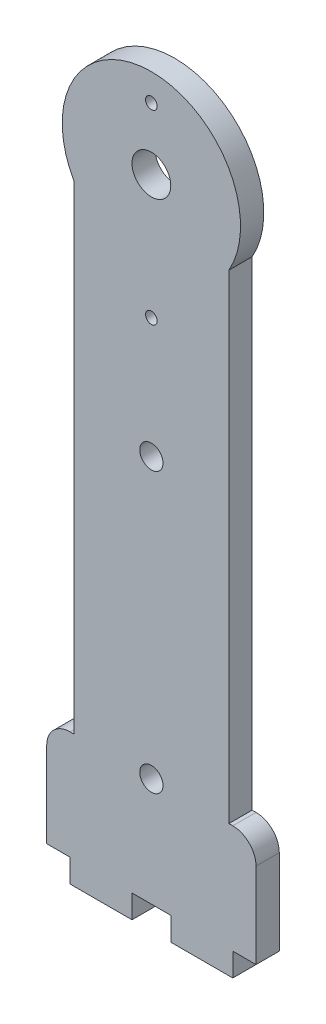
ISO-10303-21;
HEADER;
FILE_DESCRIPTION(('STEP AP214'),'2;1');
FILE_NAME('part.step','',(''),(''),'','','');
FILE_SCHEMA(('AUTOMOTIVE_DESIGN { 1 0 10303 214 1 1 1 1 }'));
ENDSEC;
DATA;
#1=APPLICATION_CONTEXT('core data for automotive mechanical design processes');
#2=APPLICATION_PROTOCOL_DEFINITION('international standard','automotive_design',2000,#1);
#3=PRODUCT_CONTEXT('',#1,'mechanical');
#4=PRODUCT('Part','Part','',(#3));
#5=PRODUCT_RELATED_PRODUCT_CATEGORY('part','',(#4));
#6=PRODUCT_DEFINITION_FORMATION('','',#4);
#7=PRODUCT_DEFINITION_CONTEXT('part definition',#1,'design');
#8=PRODUCT_DEFINITION('design','',#6,#7);
#9=PRODUCT_DEFINITION_SHAPE('','',#8);
#10=(LENGTH_UNIT() NAMED_UNIT(*) SI_UNIT(.MILLI.,.METRE.));
#11=(NAMED_UNIT(*) PLANE_ANGLE_UNIT() SI_UNIT($,.RADIAN.));
#12=(NAMED_UNIT(*) SI_UNIT($,.STERADIAN.) SOLID_ANGLE_UNIT());
#13=UNCERTAINTY_MEASURE_WITH_UNIT(LENGTH_MEASURE(1.E-05),#10,'distance_accuracy_value','');
#14=(GEOMETRIC_REPRESENTATION_CONTEXT(3) GLOBAL_UNCERTAINTY_ASSIGNED_CONTEXT((#13)) GLOBAL_UNIT_ASSIGNED_CONTEXT((#10,
#11,#12)) REPRESENTATION_CONTEXT('',''));
#15=CARTESIAN_POINT('',(0.,0.,0.));
#16=DIRECTION('',(0.,0.,1.));
#17=DIRECTION('',(1.,0.,0.));
#18=AXIS2_PLACEMENT_3D('',#15,#16,#17);
#19=CARTESIAN_POINT('',(0.,-81.5,3.));
#20=DIRECTION('',(0.,-1.,0.));
#21=DIRECTION('',(0.,0.,-1.));
#22=AXIS2_PLACEMENT_3D('',#19,#20,#21);
#23=PLANE('',#22);
#24=DIRECTION('',(0.,0.,1.));
#25=VECTOR('',#24,1.);
#26=CARTESIAN_POINT('',(2.50000000000001,-81.5,0.));
#27=LINE('',#26,#25);
#28=CARTESIAN_POINT('',(2.50000000000001,-81.5,0.));
#29=VERTEX_POINT('',#28);
#30=CARTESIAN_POINT('',(2.50000000000001,-81.5,3.));
#31=VERTEX_POINT('',#30);
#32=EDGE_CURVE('E216',#29,#31,#27,.T.);
#33=ORIENTED_EDGE('',*,*,#32,.T.);
#34=DIRECTION('',(-1.,0.,0.));
#35=VECTOR('',#34,1.);
#36=CARTESIAN_POINT('',(0.,-81.5,3.));
#37=LINE('',#36,#35);
#38=CARTESIAN_POINT('',(-2.50000000000001,-81.5,3.));
#39=VERTEX_POINT('',#38);
#40=EDGE_CURVE('E302',#31,#39,#37,.T.);
#41=ORIENTED_EDGE('',*,*,#40,.T.);
#42=DIRECTION('',(0.,0.,1.));
#43=VECTOR('',#42,1.);
#44=CARTESIAN_POINT('',(-2.50000000000001,-81.5,0.));
#45=LINE('',#44,#43);
#46=CARTESIAN_POINT('',(-2.50000000000001,-81.5,0.));
#47=VERTEX_POINT('',#46);
#48=EDGE_CURVE('E252',#47,#39,#45,.T.);
#49=ORIENTED_EDGE('',*,*,#48,.F.);
#50=DIRECTION('',(-1.,0.,0.));
#51=VECTOR('',#50,1.);
#52=CARTESIAN_POINT('',(0.,-81.5,0.));
#53=LINE('',#52,#51);
#54=EDGE_CURVE('E83',#29,#47,#53,.T.);
#55=ORIENTED_EDGE('',*,*,#54,.F.);
#56=EDGE_LOOP('',(#33,#41,#49,#55));
#57=FACE_BOUND('',#56,.T.);
#58=ADVANCED_FACE('F68',(#57),#23,.T.);
#59=CARTESIAN_POINT('',(-10.5,-81.5,0.));
#60=VERTEX_POINT('',#59);
#61=CARTESIAN_POINT('',(-13.5,-81.5,0.));
#62=VERTEX_POINT('',#61);
#63=EDGE_CURVE('E318',#60,#62,#53,.T.);
#64=ORIENTED_EDGE('',*,*,#63,.F.);
#65=DIRECTION('',(0.,0.,1.));
#66=VECTOR('',#65,1.);
#67=CARTESIAN_POINT('',(-10.5,-81.5,0.));
#68=LINE('',#67,#66);
#69=CARTESIAN_POINT('',(-10.5,-81.5,3.));
#70=VERTEX_POINT('',#69);
#71=EDGE_CURVE('E248',#60,#70,#68,.T.);
#72=ORIENTED_EDGE('',*,*,#71,.T.);
#73=CARTESIAN_POINT('',(-13.5,-81.5,3.));
#74=VERTEX_POINT('',#73);
#75=EDGE_CURVE('E298',#70,#74,#37,.T.);
#76=ORIENTED_EDGE('',*,*,#75,.T.);
#77=DIRECTION('',(0.,0.,-1.));
#78=VECTOR('',#77,1.);
#79=CARTESIAN_POINT('',(-13.5,-81.5,3.));
#80=LINE('',#79,#78);
#81=EDGE_CURVE('E332',#74,#62,#80,.T.);
#82=ORIENTED_EDGE('',*,*,#81,.T.);
#83=EDGE_LOOP('',(#64,#72,#76,#82));
#84=FACE_BOUND('',#83,.T.);
#85=ADVANCED_FACE('F387',(#84),#23,.T.);
#86=CARTESIAN_POINT('',(-9.99999999999999,0.,3.));
#87=DIRECTION('',(1.,0.,0.));
#88=DIRECTION('',(0.,1.,0.));
#89=AXIS2_PLACEMENT_3D('',#86,#87,#88);
#90=PLANE('',#89);
#91=DIRECTION('',(0.,-1.,0.));
#92=VECTOR('',#91,1.);
#93=CARTESIAN_POINT('',(-9.99999999999999,0.,0.));
#94=LINE('',#93,#92);
#95=CARTESIAN_POINT('',(-9.99999999999999,-5.67890834580029,0.));
#96=VERTEX_POINT('',#95);
#97=CARTESIAN_POINT('',(-9.99999999999999,-67.5,0.));
#98=VERTEX_POINT('',#97);
#99=EDGE_CURVE('E308',#96,#98,#94,.T.);
#100=ORIENTED_EDGE('',*,*,#99,.T.);
#101=DIRECTION('',(0.,0.,-1.));
#102=VECTOR('',#101,1.);
#103=CARTESIAN_POINT('',(-9.99999999999999,-67.5,3.));
#104=LINE('',#103,#102);
#105=CARTESIAN_POINT('',(-9.99999999999999,-67.5,3.));
#106=VERTEX_POINT('',#105);
#107=EDGE_CURVE('E335',#106,#98,#104,.T.);
#108=ORIENTED_EDGE('',*,*,#107,.F.);
#109=DIRECTION('',(0.,-1.,0.));
#110=VECTOR('',#109,1.);
#111=CARTESIAN_POINT('',(-9.99999999999999,0.,3.));
#112=LINE('',#111,#110);
#113=CARTESIAN_POINT('',(-9.99999999999999,-5.67890834580029,3.));
#114=VERTEX_POINT('',#113);
#115=EDGE_CURVE('E288',#114,#106,#112,.T.);
#116=ORIENTED_EDGE('',*,*,#115,.F.);
#117=DIRECTION('',(0.,0.,-1.));
#118=VECTOR('',#117,1.);
#119=CARTESIAN_POINT('',(-9.99999999999999,-5.67890834580029,3.));
#120=LINE('',#119,#118);
#121=EDGE_CURVE('E338',#114,#96,#120,.T.);
#122=ORIENTED_EDGE('',*,*,#121,.T.);
#123=EDGE_LOOP('',(#100,#108,#116,#122));
#124=FACE_BOUND('',#123,.T.);
#125=ADVANCED_FACE('F394',(#124),#90,.F.);
#126=CARTESIAN_POINT('',(0.,-67.5,3.));
#127=DIRECTION('',(0.,-1.,0.));
#128=DIRECTION('',(0.,0.,-1.));
#129=AXIS2_PLACEMENT_3D('',#126,#127,#128);
#130=PLANE('',#129);
#131=DIRECTION('',(-1.,0.,0.));
#132=VECTOR('',#131,1.);
#133=CARTESIAN_POINT('',(0.,-67.5,0.));
#134=LINE('',#133,#132);
#135=CARTESIAN_POINT('',(-10.5,-67.5,0.));
#136=VERTEX_POINT('',#135);
#137=EDGE_CURVE('E310',#98,#136,#134,.T.);
#138=ORIENTED_EDGE('',*,*,#137,.T.);
#139=DIRECTION('',(0.,0.,-1.));
#140=VECTOR('',#139,1.);
#141=CARTESIAN_POINT('',(-10.5,-67.5,3.));
#142=LINE('',#141,#140);
#143=CARTESIAN_POINT('',(-10.5,-67.5,3.));
#144=VERTEX_POINT('',#143);
#145=EDGE_CURVE('E351',#136,#144,#142,.F.);
#146=ORIENTED_EDGE('',*,*,#145,.T.);
#147=DIRECTION('',(-1.,0.,0.));
#148=VECTOR('',#147,1.);
#149=CARTESIAN_POINT('',(0.,-67.5,3.));
#150=LINE('',#149,#148);
#151=EDGE_CURVE('E290',#106,#144,#150,.T.);
#152=ORIENTED_EDGE('',*,*,#151,.F.);
#153=ORIENTED_EDGE('',*,*,#107,.T.);
#154=EDGE_LOOP('',(#138,#146,#152,#153));
#155=FACE_BOUND('',#154,.T.);
#156=ADVANCED_FACE('F405',(#155),#130,.F.);
#157=CARTESIAN_POINT('',(-13.5,0.,3.));
#158=DIRECTION('',(1.,0.,0.));
#159=DIRECTION('',(0.,1.,0.));
#160=AXIS2_PLACEMENT_3D('',#157,#158,#159);
#161=PLANE('',#160);
#162=DIRECTION('',(0.,-1.,0.));
#163=VECTOR('',#162,1.);
#164=CARTESIAN_POINT('',(-13.5,0.,3.));
#165=LINE('',#164,#163);
#166=CARTESIAN_POINT('',(-13.5,-70.5,3.));
#167=VERTEX_POINT('',#166);
#168=EDGE_CURVE('E294',#167,#74,#165,.T.);
#169=ORIENTED_EDGE('',*,*,#168,.F.);
#170=DIRECTION('',(0.,0.,-1.));
#171=VECTOR('',#170,1.);
#172=CARTESIAN_POINT('',(-13.5,-70.5,3.));
#173=LINE('',#172,#171);
#174=CARTESIAN_POINT('',(-13.5,-70.5,0.));
#175=VERTEX_POINT('',#174);
#176=EDGE_CURVE('E340',#167,#175,#173,.T.);
#177=ORIENTED_EDGE('',*,*,#176,.T.);
#178=DIRECTION('',(0.,-1.,0.));
#179=VECTOR('',#178,1.);
#180=CARTESIAN_POINT('',(-13.5,0.,0.));
#181=LINE('',#180,#179);
#182=EDGE_CURVE('E314',#175,#62,#181,.T.);
#183=ORIENTED_EDGE('',*,*,#182,.T.);
#184=ORIENTED_EDGE('',*,*,#81,.F.);
#185=EDGE_LOOP('',(#169,#177,#183,#184));
#186=FACE_BOUND('',#185,.T.);
#187=ADVANCED_FACE('F399',(#186),#161,.F.);
#188=DIRECTION('',(0.,0.,1.));
#189=VECTOR('',#188,1.);
#190=CARTESIAN_POINT('',(10.5,-81.5,0.));
#191=LINE('',#190,#189);
#192=CARTESIAN_POINT('',(10.5,-81.5,0.));
#193=VERTEX_POINT('',#192);
#194=CARTESIAN_POINT('',(10.5,-81.5,3.));
#195=VERTEX_POINT('',#194);
#196=EDGE_CURVE('E91',#193,#195,#191,.T.);
#197=ORIENTED_EDGE('',*,*,#196,.F.);
#198=CARTESIAN_POINT('',(13.5,-81.5,0.));
#199=VERTEX_POINT('',#198);
#200=EDGE_CURVE('E319',#199,#193,#53,.T.);
#201=ORIENTED_EDGE('',*,*,#200,.F.);
#202=DIRECTION('',(0.,0.,-1.));
#203=VECTOR('',#202,1.);
#204=CARTESIAN_POINT('',(13.5,-81.5,3.));
#205=LINE('',#204,#203);
#206=CARTESIAN_POINT('',(13.5,-81.5,3.));
#207=VERTEX_POINT('',#206);
#208=EDGE_CURVE('E329',#207,#199,#205,.T.);
#209=ORIENTED_EDGE('',*,*,#208,.F.);
#210=EDGE_CURVE('E299',#207,#195,#37,.T.);
#211=ORIENTED_EDGE('',*,*,#210,.T.);
#212=EDGE_LOOP('',(#197,#201,#209,#211));
#213=FACE_BOUND('',#212,.T.);
#214=ADVANCED_FACE('F389',(#213),#23,.T.);
#215=CARTESIAN_POINT('',(13.5,0.,3.));
#216=DIRECTION('',(1.,0.,0.));
#217=DIRECTION('',(0.,1.,0.));
#218=AXIS2_PLACEMENT_3D('',#215,#216,#217);
#219=PLANE('',#218);
#220=DIRECTION('',(0.,-1.,0.));
#221=VECTOR('',#220,1.);
#222=CARTESIAN_POINT('',(13.5,0.,0.));
#223=LINE('',#222,#221);
#224=CARTESIAN_POINT('',(13.5,-70.5,0.));
#225=VERTEX_POINT('',#224);
#226=EDGE_CURVE('E321',#225,#199,#223,.T.);
#227=ORIENTED_EDGE('',*,*,#226,.F.);
#228=DIRECTION('',(0.,0.,-1.));
#229=VECTOR('',#228,1.);
#230=CARTESIAN_POINT('',(13.5,-70.5,3.));
#231=LINE('',#230,#229);
#232=CARTESIAN_POINT('',(13.5,-70.5,3.));
#233=VERTEX_POINT('',#232);
#234=EDGE_CURVE('E12',#225,#233,#231,.F.);
#235=ORIENTED_EDGE('',*,*,#234,.T.);
#236=DIRECTION('',(0.,-1.,0.));
#237=VECTOR('',#236,1.);
#238=CARTESIAN_POINT('',(13.5,0.,3.));
#239=LINE('',#238,#237);
#240=EDGE_CURVE('E301',#233,#207,#239,.T.);
#241=ORIENTED_EDGE('',*,*,#240,.T.);
#242=ORIENTED_EDGE('',*,*,#208,.T.);
#243=EDGE_LOOP('',(#227,#235,#241,#242));
#244=FACE_BOUND('',#243,.T.);
#245=ADVANCED_FACE('F380',(#244),#219,.T.);
#246=CARTESIAN_POINT('',(10.5,-67.5,3.));
#247=VERTEX_POINT('',#246);
#248=CARTESIAN_POINT('',(10.,-67.5,3.));
#249=VERTEX_POINT('',#248);
#250=EDGE_CURVE('E295',#247,#249,#150,.T.);
#251=ORIENTED_EDGE('',*,*,#250,.F.);
#252=DIRECTION('',(0.,0.,-1.));
#253=VECTOR('',#252,1.);
#254=CARTESIAN_POINT('',(10.5,-67.5,0.));
#255=LINE('',#254,#253);
#256=CARTESIAN_POINT('',(10.5,-67.5,0.));
#257=VERTEX_POINT('',#256);
#258=EDGE_CURVE('E76',#247,#257,#255,.T.);
#259=ORIENTED_EDGE('',*,*,#258,.T.);
#260=CARTESIAN_POINT('',(10.,-67.5,0.));
#261=VERTEX_POINT('',#260);
#262=EDGE_CURVE('E315',#257,#261,#134,.T.);
#263=ORIENTED_EDGE('',*,*,#262,.T.);
#264=DIRECTION('',(0.,0.,-1.));
#265=VECTOR('',#264,1.);
#266=CARTESIAN_POINT('',(10.,-67.5,3.));
#267=LINE('',#266,#265);
#268=EDGE_CURVE('E326',#249,#261,#267,.T.);
#269=ORIENTED_EDGE('',*,*,#268,.F.);
#270=EDGE_LOOP('',(#251,#259,#263,#269));
#271=FACE_BOUND('',#270,.T.);
#272=ADVANCED_FACE('F361',(#271),#130,.F.);
#273=CARTESIAN_POINT('',(10.,0.,3.));
#274=DIRECTION('',(1.,0.,0.));
#275=DIRECTION('',(0.,1.,0.));
#276=AXIS2_PLACEMENT_3D('',#273,#274,#275);
#277=PLANE('',#276);
#278=DIRECTION('',(0.,-1.,0.));
#279=VECTOR('',#278,1.);
#280=CARTESIAN_POINT('',(10.,0.,0.));
#281=LINE('',#280,#279);
#282=CARTESIAN_POINT('',(10.,-5.67890834580027,0.));
#283=VERTEX_POINT('',#282);
#284=EDGE_CURVE('E291',#283,#261,#281,.T.);
#285=ORIENTED_EDGE('',*,*,#284,.F.);
#286=DIRECTION('',(0.,0.,-1.));
#287=VECTOR('',#286,1.);
#288=CARTESIAN_POINT('',(10.,-5.67890834580027,3.));
#289=LINE('',#288,#287);
#290=CARTESIAN_POINT('',(10.,-5.67890834580027,3.));
#291=VERTEX_POINT('',#290);
#292=EDGE_CURVE('E307',#291,#283,#289,.T.);
#293=ORIENTED_EDGE('',*,*,#292,.F.);
#294=DIRECTION('',(0.,-1.,0.));
#295=VECTOR('',#294,1.);
#296=CARTESIAN_POINT('',(10.,0.,3.));
#297=LINE('',#296,#295);
#298=EDGE_CURVE('E304',#291,#249,#297,.T.);
#299=ORIENTED_EDGE('',*,*,#298,.T.);
#300=ORIENTED_EDGE('',*,*,#268,.T.);
#301=EDGE_LOOP('',(#285,#293,#299,#300));
#302=FACE_BOUND('',#301,.T.);
#303=ADVANCED_FACE('F370',(#302),#277,.T.);
#304=CARTESIAN_POINT('',(0.,0.,0.));
#305=DIRECTION('',(0.,0.,1.));
#306=DIRECTION('',(1.,0.,0.));
#307=AXIS2_PLACEMENT_3D('',#304,#305,#306);
#308=PLANE('',#307);
#309=CARTESIAN_POINT('',(0.,-16.,0.));
#310=DIRECTION('',(0.,0.,1.));
#311=DIRECTION('',(1.,0.,0.));
#312=AXIS2_PLACEMENT_3D('',#309,#310,#311);
#313=CIRCLE('',#312,0.75);
#314=CARTESIAN_POINT('',(0.750000000000002,-16.,0.));
#315=VERTEX_POINT('',#314);
#316=EDGE_CURVE('E258',#315,#315,#313,.T.);
#317=ORIENTED_EDGE('',*,*,#316,.T.);
#318=EDGE_LOOP('',(#317));
#319=FACE_BOUND('',#318,.T.);
#320=CARTESIAN_POINT('',(0.,8.,0.));
#321=DIRECTION('',(0.,0.,1.));
#322=DIRECTION('',(1.,0.,0.));
#323=AXIS2_PLACEMENT_3D('',#320,#321,#322);
#324=CIRCLE('',#323,0.750000000000001);
#325=CARTESIAN_POINT('',(0.750000000000001,8.,0.));
#326=VERTEX_POINT('',#325);
#327=EDGE_CURVE('E265',#326,#326,#324,.T.);
#328=ORIENTED_EDGE('',*,*,#327,.T.);
#329=EDGE_LOOP('',(#328));
#330=FACE_BOUND('',#329,.T.);
#331=CARTESIAN_POINT('',(0.,0.,0.));
#332=DIRECTION('',(0.,0.,1.));
#333=DIRECTION('',(1.,0.,0.));
#334=AXIS2_PLACEMENT_3D('',#331,#332,#333);
#335=CIRCLE('',#334,2.5);
#336=CARTESIAN_POINT('',(2.5,0.,0.));
#337=VERTEX_POINT('',#336);
#338=EDGE_CURVE('E270',#337,#337,#335,.T.);
#339=ORIENTED_EDGE('',*,*,#338,.T.);
#340=EDGE_LOOP('',(#339));
#341=FACE_BOUND('',#340,.T.);
#342=CARTESIAN_POINT('',(0.,-31.5,0.));
#343=DIRECTION('',(0.,0.,1.));
#344=DIRECTION('',(1.,0.,0.));
#345=AXIS2_PLACEMENT_3D('',#342,#343,#344);
#346=CIRCLE('',#345,1.5);
#347=CARTESIAN_POINT('',(1.5,-31.5,0.));
#348=VERTEX_POINT('',#347);
#349=EDGE_CURVE('E277',#348,#348,#346,.T.);
#350=ORIENTED_EDGE('',*,*,#349,.T.);
#351=EDGE_LOOP('',(#350));
#352=FACE_BOUND('',#351,.T.);
#353=CARTESIAN_POINT('',(0.,-67.5,0.));
#354=DIRECTION('',(0.,0.,1.));
#355=DIRECTION('',(1.,0.,0.));
#356=AXIS2_PLACEMENT_3D('',#353,#354,#355);
#357=CIRCLE('',#356,1.5);
#358=CARTESIAN_POINT('',(1.50000000000001,-67.5,0.));
#359=VERTEX_POINT('',#358);
#360=EDGE_CURVE('E283',#359,#359,#357,.T.);
#361=ORIENTED_EDGE('',*,*,#360,.T.);
#362=EDGE_LOOP('',(#361));
#363=FACE_BOUND('',#362,.T.);
#364=ORIENTED_EDGE('',*,*,#182,.F.);
#365=CARTESIAN_POINT('',(-10.5,-70.5,0.));
#366=DIRECTION('',(0.,0.,1.));
#367=DIRECTION('',(1.,0.,0.));
#368=AXIS2_PLACEMENT_3D('',#365,#366,#367);
#369=CIRCLE('',#368,3.);
#370=EDGE_CURVE('E349',#175,#136,#369,.F.);
#371=ORIENTED_EDGE('',*,*,#370,.T.);
#372=ORIENTED_EDGE('',*,*,#137,.F.);
#373=ORIENTED_EDGE('',*,*,#99,.F.);
#374=CARTESIAN_POINT('',(0.,0.,0.));
#375=DIRECTION('',(0.,0.,1.));
#376=DIRECTION('',(1.,0.,0.));
#377=AXIS2_PLACEMENT_3D('',#374,#375,#376);
#378=CIRCLE('',#377,11.5);
#379=EDGE_CURVE('E273',#283,#96,#378,.T.);
#380=ORIENTED_EDGE('',*,*,#379,.F.);
#381=ORIENTED_EDGE('',*,*,#284,.T.);
#382=ORIENTED_EDGE('',*,*,#262,.F.);
#383=CARTESIAN_POINT('',(10.5,-70.5,0.));
#384=DIRECTION('',(0.,0.,1.));
#385=DIRECTION('',(1.,0.,0.));
#386=AXIS2_PLACEMENT_3D('',#383,#384,#385);
#387=CIRCLE('',#386,3.);
#388=EDGE_CURVE('E347',#257,#225,#387,.F.);
#389=ORIENTED_EDGE('',*,*,#388,.T.);
#390=ORIENTED_EDGE('',*,*,#226,.T.);
#391=ORIENTED_EDGE('',*,*,#200,.T.);
#392=DIRECTION('',(0.,1.,0.));
#393=VECTOR('',#392,1.);
#394=CARTESIAN_POINT('',(10.5,-81.5,0.));
#395=LINE('',#394,#393);
#396=CARTESIAN_POINT('',(10.5,-84.5,0.));
#397=VERTEX_POINT('',#396);
#398=EDGE_CURVE('E205',#397,#193,#395,.T.);
#399=ORIENTED_EDGE('',*,*,#398,.F.);
#400=DIRECTION('',(1.,0.,0.));
#401=VECTOR('',#400,1.);
#402=CARTESIAN_POINT('',(2.50000000000001,-84.5,0.));
#403=LINE('',#402,#401);
#404=CARTESIAN_POINT('',(2.50000000000001,-84.5,0.));
#405=VERTEX_POINT('',#404);
#406=EDGE_CURVE('E197',#405,#397,#403,.T.);
#407=ORIENTED_EDGE('',*,*,#406,.F.);
#408=DIRECTION('',(0.,-1.,0.));
#409=VECTOR('',#408,1.);
#410=CARTESIAN_POINT('',(2.50000000000001,-81.5,0.));
#411=LINE('',#410,#409);
#412=EDGE_CURVE('E212',#29,#405,#411,.T.);
#413=ORIENTED_EDGE('',*,*,#412,.F.);
#414=ORIENTED_EDGE('',*,*,#54,.T.);
#415=DIRECTION('',(0.,1.,0.));
#416=VECTOR('',#415,1.);
#417=CARTESIAN_POINT('',(-2.50000000000001,-81.5,0.));
#418=LINE('',#417,#416);
#419=CARTESIAN_POINT('',(-2.50000000000001,-84.5,0.));
#420=VERTEX_POINT('',#419);
#421=EDGE_CURVE('E237',#420,#47,#418,.T.);
#422=ORIENTED_EDGE('',*,*,#421,.F.);
#423=DIRECTION('',(1.,0.,0.));
#424=VECTOR('',#423,1.);
#425=CARTESIAN_POINT('',(-10.5,-84.5,0.));
#426=LINE('',#425,#424);
#427=CARTESIAN_POINT('',(-10.5,-84.5,0.));
#428=VERTEX_POINT('',#427);
#429=EDGE_CURVE('E233',#428,#420,#426,.T.);
#430=ORIENTED_EDGE('',*,*,#429,.F.);
#431=DIRECTION('',(0.,-1.,0.));
#432=VECTOR('',#431,1.);
#433=CARTESIAN_POINT('',(-10.5,-81.5,0.));
#434=LINE('',#433,#432);
#435=EDGE_CURVE('E230',#60,#428,#434,.T.);
#436=ORIENTED_EDGE('',*,*,#435,.F.);
#437=ORIENTED_EDGE('',*,*,#63,.T.);
#438=EDGE_LOOP('',(#364,#371,#372,#373,#380,#381,#382,#389,#390,#391,#399,#407,#413,#414,#422,
#430,#436,#437));
#439=FACE_BOUND('',#438,.T.);
#440=ADVANCED_FACE('F211',(#319,#330,#341,#352,#363,#439),#308,.F.);
#441=CARTESIAN_POINT('',(0.,0.,3.));
#442=DIRECTION('',(0.,0.,1.));
#443=DIRECTION('',(1.,0.,0.));
#444=AXIS2_PLACEMENT_3D('',#441,#442,#443);
#445=PLANE('',#444);
#446=CARTESIAN_POINT('',(0.,-16.,3.));
#447=DIRECTION('',(0.,0.,1.));
#448=DIRECTION('',(1.,0.,0.));
#449=AXIS2_PLACEMENT_3D('',#446,#447,#448);
#450=CIRCLE('',#449,0.75);
#451=CARTESIAN_POINT('',(0.750000000000002,-16.,3.));
#452=VERTEX_POINT('',#451);
#453=EDGE_CURVE('E262',#452,#452,#450,.T.);
#454=ORIENTED_EDGE('',*,*,#453,.F.);
#455=EDGE_LOOP('',(#454));
#456=FACE_BOUND('',#455,.T.);
#457=CARTESIAN_POINT('',(0.,8.,3.));
#458=DIRECTION('',(0.,0.,1.));
#459=DIRECTION('',(1.,0.,0.));
#460=AXIS2_PLACEMENT_3D('',#457,#458,#459);
#461=CIRCLE('',#460,0.750000000000001);
#462=CARTESIAN_POINT('',(0.750000000000001,8.,3.));
#463=VERTEX_POINT('',#462);
#464=EDGE_CURVE('E251',#463,#463,#461,.T.);
#465=ORIENTED_EDGE('',*,*,#464,.F.);
#466=EDGE_LOOP('',(#465));
#467=FACE_BOUND('',#466,.T.);
#468=CARTESIAN_POINT('',(0.,0.,3.));
#469=DIRECTION('',(0.,0.,1.));
#470=DIRECTION('',(1.,0.,0.));
#471=AXIS2_PLACEMENT_3D('',#468,#469,#470);
#472=CIRCLE('',#471,2.5);
#473=CARTESIAN_POINT('',(2.5,0.,3.));
#474=VERTEX_POINT('',#473);
#475=EDGE_CURVE('E274',#474,#474,#472,.T.);
#476=ORIENTED_EDGE('',*,*,#475,.F.);
#477=EDGE_LOOP('',(#476));
#478=FACE_BOUND('',#477,.T.);
#479=CARTESIAN_POINT('',(0.,-31.5,3.));
#480=DIRECTION('',(0.,0.,1.));
#481=DIRECTION('',(1.,0.,0.));
#482=AXIS2_PLACEMENT_3D('',#479,#480,#481);
#483=CIRCLE('',#482,1.5);
#484=CARTESIAN_POINT('',(1.5,-31.5,3.));
#485=VERTEX_POINT('',#484);
#486=EDGE_CURVE('E280',#485,#485,#483,.T.);
#487=ORIENTED_EDGE('',*,*,#486,.F.);
#488=EDGE_LOOP('',(#487));
#489=FACE_BOUND('',#488,.T.);
#490=CARTESIAN_POINT('',(0.,-67.5,3.));
#491=DIRECTION('',(0.,0.,1.));
#492=DIRECTION('',(1.,0.,0.));
#493=AXIS2_PLACEMENT_3D('',#490,#491,#492);
#494=CIRCLE('',#493,1.5);
#495=CARTESIAN_POINT('',(1.50000000000001,-67.5,3.));
#496=VERTEX_POINT('',#495);
#497=EDGE_CURVE('E261',#496,#496,#494,.T.);
#498=ORIENTED_EDGE('',*,*,#497,.F.);
#499=EDGE_LOOP('',(#498));
#500=FACE_BOUND('',#499,.T.);
#501=ORIENTED_EDGE('',*,*,#151,.T.);
#502=CARTESIAN_POINT('',(-10.5,-70.5,3.));
#503=DIRECTION('',(0.,0.,1.));
#504=DIRECTION('',(1.,0.,0.));
#505=AXIS2_PLACEMENT_3D('',#502,#503,#504);
#506=CIRCLE('',#505,3.);
#507=EDGE_CURVE('E355',#144,#167,#506,.T.);
#508=ORIENTED_EDGE('',*,*,#507,.T.);
#509=ORIENTED_EDGE('',*,*,#168,.T.);
#510=ORIENTED_EDGE('',*,*,#75,.F.);
#511=DIRECTION('',(0.,-1.,0.));
#512=VECTOR('',#511,1.);
#513=CARTESIAN_POINT('',(-10.5,-81.5,3.));
#514=LINE('',#513,#512);
#515=CARTESIAN_POINT('',(-10.5,-84.5,3.));
#516=VERTEX_POINT('',#515);
#517=EDGE_CURVE('E227',#70,#516,#514,.T.);
#518=ORIENTED_EDGE('',*,*,#517,.T.);
#519=DIRECTION('',(1.,0.,0.));
#520=VECTOR('',#519,1.);
#521=CARTESIAN_POINT('',(-10.5,-84.5,3.));
#522=LINE('',#521,#520);
#523=CARTESIAN_POINT('',(-2.50000000000001,-84.5,3.));
#524=VERTEX_POINT('',#523);
#525=EDGE_CURVE('E243',#516,#524,#522,.T.);
#526=ORIENTED_EDGE('',*,*,#525,.T.);
#527=DIRECTION('',(0.,1.,0.));
#528=VECTOR('',#527,1.);
#529=CARTESIAN_POINT('',(-2.50000000000001,-81.5,3.));
#530=LINE('',#529,#528);
#531=EDGE_CURVE('E234',#524,#39,#530,.T.);
#532=ORIENTED_EDGE('',*,*,#531,.T.);
#533=ORIENTED_EDGE('',*,*,#40,.F.);
#534=DIRECTION('',(0.,-1.,0.));
#535=VECTOR('',#534,1.);
#536=CARTESIAN_POINT('',(2.50000000000001,-81.5,3.));
#537=LINE('',#536,#535);
#538=CARTESIAN_POINT('',(2.50000000000001,-84.5,3.));
#539=VERTEX_POINT('',#538);
#540=EDGE_CURVE('E223',#31,#539,#537,.T.);
#541=ORIENTED_EDGE('',*,*,#540,.T.);
#542=DIRECTION('',(1.,0.,0.));
#543=VECTOR('',#542,1.);
#544=CARTESIAN_POINT('',(2.50000000000001,-84.5,3.));
#545=LINE('',#544,#543);
#546=CARTESIAN_POINT('',(10.5,-84.5,3.));
#547=VERTEX_POINT('',#546);
#548=EDGE_CURVE('E199',#539,#547,#545,.T.);
#549=ORIENTED_EDGE('',*,*,#548,.T.);
#550=DIRECTION('',(0.,1.,0.));
#551=VECTOR('',#550,1.);
#552=CARTESIAN_POINT('',(10.5,-81.5,3.));
#553=LINE('',#552,#551);
#554=EDGE_CURVE('E217',#547,#195,#553,.T.);
#555=ORIENTED_EDGE('',*,*,#554,.T.);
#556=ORIENTED_EDGE('',*,*,#210,.F.);
#557=ORIENTED_EDGE('',*,*,#240,.F.);
#558=CARTESIAN_POINT('',(10.5,-70.5,3.));
#559=DIRECTION('',(0.,0.,1.));
#560=DIRECTION('',(1.,0.,0.));
#561=AXIS2_PLACEMENT_3D('',#558,#559,#560);
#562=CIRCLE('',#561,3.);
#563=EDGE_CURVE('E353',#233,#247,#562,.T.);
#564=ORIENTED_EDGE('',*,*,#563,.T.);
#565=ORIENTED_EDGE('',*,*,#250,.T.);
#566=ORIENTED_EDGE('',*,*,#298,.F.);
#567=CARTESIAN_POINT('',(0.,0.,3.));
#568=DIRECTION('',(0.,0.,1.));
#569=DIRECTION('',(1.,0.,0.));
#570=AXIS2_PLACEMENT_3D('',#567,#568,#569);
#571=CIRCLE('',#570,11.5);
#572=EDGE_CURVE('E311',#291,#114,#571,.T.);
#573=ORIENTED_EDGE('',*,*,#572,.T.);
#574=ORIENTED_EDGE('',*,*,#115,.T.);
#575=EDGE_LOOP('',(#501,#508,#509,#510,#518,#526,#532,#533,#541,#549,#555,#556,#557,#564,#565,
#566,#573,#574));
#576=FACE_BOUND('',#575,.T.);
#577=ADVANCED_FACE('F374',(#456,#467,#478,#489,#500,#576),#445,.T.);
#578=CARTESIAN_POINT('',(0.,0.,3.));
#579=DIRECTION('',(0.,0.,-1.));
#580=DIRECTION('',(-1.,0.,0.));
#581=AXIS2_PLACEMENT_3D('',#578,#579,#580);
#582=CYLINDRICAL_SURFACE('',#581,11.5);
#583=ORIENTED_EDGE('',*,*,#379,.T.);
#584=ORIENTED_EDGE('',*,*,#121,.F.);
#585=ORIENTED_EDGE('',*,*,#572,.F.);
#586=ORIENTED_EDGE('',*,*,#292,.T.);
#587=EDGE_LOOP('',(#583,#584,#585,#586));
#588=FACE_BOUND('',#587,.T.);
#589=ADVANCED_FACE('F417',(#588),#582,.T.);
#590=CARTESIAN_POINT('',(0.,-67.5,0.));
#591=DIRECTION('',(0.,0.,1.));
#592=DIRECTION('',(1.,0.,0.));
#593=AXIS2_PLACEMENT_3D('',#590,#591,#592);
#594=CYLINDRICAL_SURFACE('',#593,1.5);
#595=ORIENTED_EDGE('',*,*,#360,.F.);
#596=EDGE_LOOP('',(#595));
#597=FACE_BOUND('',#596,.T.);
#598=ORIENTED_EDGE('',*,*,#497,.T.);
#599=EDGE_LOOP('',(#598));
#600=FACE_BOUND('',#599,.T.);
#601=ADVANCED_FACE('F419',(#597,#600),#594,.F.);
#602=CARTESIAN_POINT('',(0.,-31.5,0.));
#603=DIRECTION('',(0.,0.,1.));
#604=DIRECTION('',(1.,0.,0.));
#605=AXIS2_PLACEMENT_3D('',#602,#603,#604);
#606=CYLINDRICAL_SURFACE('',#605,1.5);
#607=ORIENTED_EDGE('',*,*,#349,.F.);
#608=EDGE_LOOP('',(#607));
#609=FACE_BOUND('',#608,.T.);
#610=ORIENTED_EDGE('',*,*,#486,.T.);
#611=EDGE_LOOP('',(#610));
#612=FACE_BOUND('',#611,.T.);
#613=ADVANCED_FACE('F430',(#609,#612),#606,.F.);
#614=CARTESIAN_POINT('',(0.,0.,0.));
#615=DIRECTION('',(0.,0.,1.));
#616=DIRECTION('',(1.,0.,0.));
#617=AXIS2_PLACEMENT_3D('',#614,#615,#616);
#618=CYLINDRICAL_SURFACE('',#617,2.5);
#619=ORIENTED_EDGE('',*,*,#338,.F.);
#620=EDGE_LOOP('',(#619));
#621=FACE_BOUND('',#620,.T.);
#622=ORIENTED_EDGE('',*,*,#475,.T.);
#623=EDGE_LOOP('',(#622));
#624=FACE_BOUND('',#623,.T.);
#625=ADVANCED_FACE('F423',(#621,#624),#618,.F.);
#626=CARTESIAN_POINT('',(-10.5,-70.5,3.));
#627=DIRECTION('',(0.,0.,-1.));
#628=DIRECTION('',(-1.,0.,0.));
#629=AXIS2_PLACEMENT_3D('',#626,#627,#628);
#630=CYLINDRICAL_SURFACE('',#629,3.);
#631=ORIENTED_EDGE('',*,*,#507,.F.);
#632=ORIENTED_EDGE('',*,*,#145,.F.);
#633=ORIENTED_EDGE('',*,*,#370,.F.);
#634=ORIENTED_EDGE('',*,*,#176,.F.);
#635=EDGE_LOOP('',(#631,#632,#633,#634));
#636=FACE_BOUND('',#635,.T.);
#637=ADVANCED_FACE('F421',(#636),#630,.T.);
#638=CARTESIAN_POINT('',(10.5,-70.5,3.));
#639=DIRECTION('',(0.,0.,1.));
#640=DIRECTION('',(1.,0.,0.));
#641=AXIS2_PLACEMENT_3D('',#638,#639,#640);
#642=CYLINDRICAL_SURFACE('',#641,3.);
#643=ORIENTED_EDGE('',*,*,#563,.F.);
#644=ORIENTED_EDGE('',*,*,#234,.F.);
#645=ORIENTED_EDGE('',*,*,#388,.F.);
#646=ORIENTED_EDGE('',*,*,#258,.F.);
#647=EDGE_LOOP('',(#643,#644,#645,#646));
#648=FACE_BOUND('',#647,.T.);
#649=ADVANCED_FACE('F70',(#648),#642,.T.);
#650=CARTESIAN_POINT('',(0.,8.,0.));
#651=DIRECTION('',(0.,0.,1.));
#652=DIRECTION('',(1.,0.,0.));
#653=AXIS2_PLACEMENT_3D('',#650,#651,#652);
#654=CYLINDRICAL_SURFACE('',#653,0.750000000000001);
#655=ORIENTED_EDGE('',*,*,#327,.F.);
#656=EDGE_LOOP('',(#655));
#657=FACE_BOUND('',#656,.T.);
#658=ORIENTED_EDGE('',*,*,#464,.T.);
#659=EDGE_LOOP('',(#658));
#660=FACE_BOUND('',#659,.T.);
#661=ADVANCED_FACE('F429',(#657,#660),#654,.F.);
#662=CARTESIAN_POINT('',(0.,-16.,0.));
#663=DIRECTION('',(0.,0.,1.));
#664=DIRECTION('',(1.,0.,0.));
#665=AXIS2_PLACEMENT_3D('',#662,#663,#664);
#666=CYLINDRICAL_SURFACE('',#665,0.75);
#667=ORIENTED_EDGE('',*,*,#316,.F.);
#668=EDGE_LOOP('',(#667));
#669=FACE_BOUND('',#668,.T.);
#670=ORIENTED_EDGE('',*,*,#453,.T.);
#671=EDGE_LOOP('',(#670));
#672=FACE_BOUND('',#671,.T.);
#673=ADVANCED_FACE('F459',(#669,#672),#666,.F.);
#674=CARTESIAN_POINT('',(-10.5,-81.5,0.));
#675=DIRECTION('',(-1.,0.,0.));
#676=DIRECTION('',(0.,0.,1.));
#677=AXIS2_PLACEMENT_3D('',#674,#675,#676);
#678=PLANE('',#677);
#679=ORIENTED_EDGE('',*,*,#517,.F.);
#680=ORIENTED_EDGE('',*,*,#71,.F.);
#681=ORIENTED_EDGE('',*,*,#435,.T.);
#682=DIRECTION('',(0.,0.,1.));
#683=VECTOR('',#682,1.);
#684=CARTESIAN_POINT('',(-10.5,-84.5,0.));
#685=LINE('',#684,#683);
#686=EDGE_CURVE('E240',#428,#516,#685,.T.);
#687=ORIENTED_EDGE('',*,*,#686,.T.);
#688=EDGE_LOOP('',(#679,#680,#681,#687));
#689=FACE_BOUND('',#688,.T.);
#690=ADVANCED_FACE('F442',(#689),#678,.T.);
#691=CARTESIAN_POINT('',(-2.50000000000001,-81.5,0.));
#692=DIRECTION('',(1.,0.,0.));
#693=DIRECTION('',(0.,0.,-1.));
#694=AXIS2_PLACEMENT_3D('',#691,#692,#693);
#695=PLANE('',#694);
#696=ORIENTED_EDGE('',*,*,#531,.F.);
#697=DIRECTION('',(0.,0.,1.));
#698=VECTOR('',#697,1.);
#699=CARTESIAN_POINT('',(-2.50000000000001,-84.5,0.));
#700=LINE('',#699,#698);
#701=EDGE_CURVE('E255',#420,#524,#700,.T.);
#702=ORIENTED_EDGE('',*,*,#701,.F.);
#703=ORIENTED_EDGE('',*,*,#421,.T.);
#704=ORIENTED_EDGE('',*,*,#48,.T.);
#705=EDGE_LOOP('',(#696,#702,#703,#704));
#706=FACE_BOUND('',#705,.T.);
#707=ADVANCED_FACE('F449',(#706),#695,.T.);
#708=CARTESIAN_POINT('',(-10.5,-84.5,0.));
#709=DIRECTION('',(0.,-1.,0.));
#710=DIRECTION('',(0.,0.,-1.));
#711=AXIS2_PLACEMENT_3D('',#708,#709,#710);
#712=PLANE('',#711);
#713=ORIENTED_EDGE('',*,*,#525,.F.);
#714=ORIENTED_EDGE('',*,*,#686,.F.);
#715=ORIENTED_EDGE('',*,*,#429,.T.);
#716=ORIENTED_EDGE('',*,*,#701,.T.);
#717=EDGE_LOOP('',(#713,#714,#715,#716));
#718=FACE_BOUND('',#717,.T.);
#719=ADVANCED_FACE('F446',(#718),#712,.T.);
#720=CARTESIAN_POINT('',(2.50000000000001,-81.5,0.));
#721=DIRECTION('',(-1.,0.,0.));
#722=DIRECTION('',(0.,-1.,0.));
#723=AXIS2_PLACEMENT_3D('',#720,#721,#722);
#724=PLANE('',#723);
#725=ORIENTED_EDGE('',*,*,#540,.F.);
#726=ORIENTED_EDGE('',*,*,#32,.F.);
#727=ORIENTED_EDGE('',*,*,#412,.T.);
#728=DIRECTION('',(0.,0.,1.));
#729=VECTOR('',#728,1.);
#730=CARTESIAN_POINT('',(2.50000000000001,-84.5,0.));
#731=LINE('',#730,#729);
#732=EDGE_CURVE('E194',#405,#539,#731,.T.);
#733=ORIENTED_EDGE('',*,*,#732,.T.);
#734=EDGE_LOOP('',(#725,#726,#727,#733));
#735=FACE_BOUND('',#734,.T.);
#736=ADVANCED_FACE('F215',(#735),#724,.T.);
#737=CARTESIAN_POINT('',(10.5,-81.5,0.));
#738=DIRECTION('',(1.,0.,0.));
#739=DIRECTION('',(0.,0.,-1.));
#740=AXIS2_PLACEMENT_3D('',#737,#738,#739);
#741=PLANE('',#740);
#742=ORIENTED_EDGE('',*,*,#554,.F.);
#743=DIRECTION('',(0.,0.,1.));
#744=VECTOR('',#743,1.);
#745=CARTESIAN_POINT('',(10.5,-84.5,0.));
#746=LINE('',#745,#744);
#747=EDGE_CURVE('E204',#397,#547,#746,.T.);
#748=ORIENTED_EDGE('',*,*,#747,.F.);
#749=ORIENTED_EDGE('',*,*,#398,.T.);
#750=ORIENTED_EDGE('',*,*,#196,.T.);
#751=EDGE_LOOP('',(#742,#748,#749,#750));
#752=FACE_BOUND('',#751,.T.);
#753=ADVANCED_FACE('F384',(#752),#741,.T.);
#754=CARTESIAN_POINT('',(2.50000000000001,-84.5,0.));
#755=DIRECTION('',(0.,-1.,0.));
#756=DIRECTION('',(0.,0.,-1.));
#757=AXIS2_PLACEMENT_3D('',#754,#755,#756);
#758=PLANE('',#757);
#759=ORIENTED_EDGE('',*,*,#548,.F.);
#760=ORIENTED_EDGE('',*,*,#732,.F.);
#761=ORIENTED_EDGE('',*,*,#406,.T.);
#762=ORIENTED_EDGE('',*,*,#747,.T.);
#763=EDGE_LOOP('',(#759,#760,#761,#762));
#764=FACE_BOUND('',#763,.T.);
#765=ADVANCED_FACE('F196',(#764),#758,.T.);
#766=CLOSED_SHELL('',(#58,#85,#125,#156,#187,#214,#245,#272,#303,#440,#577,#589,#601,#613,#625,
#637,#649,#661,#673,#690,#707,#719,#736,#753,#765));
#767=MANIFOLD_SOLID_BREP('B2',#766);
#768=ADVANCED_BREP_SHAPE_REPRESENTATION('',(#18,#767),#14);
#769=SHAPE_DEFINITION_REPRESENTATION(#9,#768);
ENDSEC;
END-ISO-10303-21;
